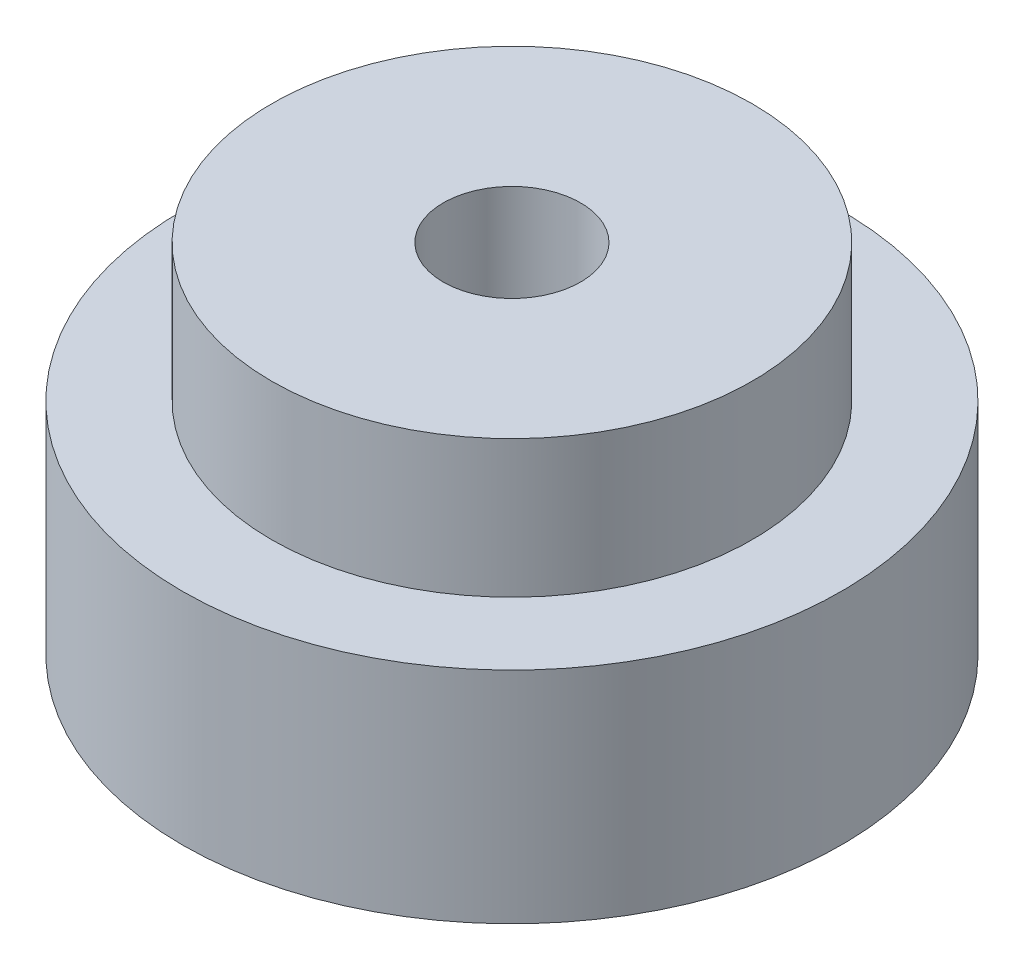
ISO-10303-21;
HEADER;
FILE_DESCRIPTION(('STEP AP214'),'2;1');
FILE_NAME('part.step','',(''),(''),'','','');
FILE_SCHEMA(('AUTOMOTIVE_DESIGN { 1 0 10303 214 1 1 1 1 }'));
ENDSEC;
DATA;
#1=APPLICATION_CONTEXT('core data for automotive mechanical design processes');
#2=APPLICATION_PROTOCOL_DEFINITION('international standard','automotive_design',2000,#1);
#3=PRODUCT_CONTEXT('',#1,'mechanical');
#4=PRODUCT('Part','Part','',(#3));
#5=PRODUCT_RELATED_PRODUCT_CATEGORY('part','',(#4));
#6=PRODUCT_DEFINITION_FORMATION('','',#4);
#7=PRODUCT_DEFINITION_CONTEXT('part definition',#1,'design');
#8=PRODUCT_DEFINITION('design','',#6,#7);
#9=PRODUCT_DEFINITION_SHAPE('','',#8);
#10=(LENGTH_UNIT() NAMED_UNIT(*) SI_UNIT(.MILLI.,.METRE.));
#11=(NAMED_UNIT(*) PLANE_ANGLE_UNIT() SI_UNIT($,.RADIAN.));
#12=(NAMED_UNIT(*) SI_UNIT($,.STERADIAN.) SOLID_ANGLE_UNIT());
#13=UNCERTAINTY_MEASURE_WITH_UNIT(LENGTH_MEASURE(1.E-05),#10,'distance_accuracy_value','');
#14=(GEOMETRIC_REPRESENTATION_CONTEXT(3) GLOBAL_UNCERTAINTY_ASSIGNED_CONTEXT((#13)) GLOBAL_UNIT_ASSIGNED_CONTEXT((#10,
#11,#12)) REPRESENTATION_CONTEXT('',''));
#15=CARTESIAN_POINT('',(0.,0.,0.));
#16=DIRECTION('',(0.,0.,1.));
#17=DIRECTION('',(1.,0.,0.));
#18=AXIS2_PLACEMENT_3D('',#15,#16,#17);
#19=CARTESIAN_POINT('',(0.,16.,0.));
#20=DIRECTION('',(0.,-1.,0.));
#21=DIRECTION('',(0.,0.,-1.));
#22=AXIS2_PLACEMENT_3D('',#19,#20,#21);
#23=CYLINDRICAL_SURFACE('',#22,24.);
#24=CARTESIAN_POINT('',(0.,16.,0.));
#25=DIRECTION('',(0.,1.,0.));
#26=DIRECTION('',(0.,0.,1.));
#27=AXIS2_PLACEMENT_3D('',#24,#25,#26);
#28=CIRCLE('',#27,24.);
#29=CARTESIAN_POINT('',(0.,16.,24.));
#30=VERTEX_POINT('',#29);
#31=EDGE_CURVE('E10',#30,#30,#28,.T.);
#32=ORIENTED_EDGE('',*,*,#31,.F.);
#33=EDGE_LOOP('',(#32));
#34=FACE_BOUND('',#33,.T.);
#35=CARTESIAN_POINT('',(0.,0.,0.));
#36=DIRECTION('',(0.,1.,0.));
#37=DIRECTION('',(0.,0.,1.));
#38=AXIS2_PLACEMENT_3D('',#35,#36,#37);
#39=CIRCLE('',#38,24.);
#40=CARTESIAN_POINT('',(0.,0.,24.));
#41=VERTEX_POINT('',#40);
#42=EDGE_CURVE('E34',#41,#41,#39,.T.);
#43=ORIENTED_EDGE('',*,*,#42,.T.);
#44=EDGE_LOOP('',(#43));
#45=FACE_BOUND('',#44,.T.);
#46=ADVANCED_FACE('F31',(#34,#45),#23,.T.);
#47=CARTESIAN_POINT('',(0.,16.,0.));
#48=DIRECTION('',(0.,1.,0.));
#49=DIRECTION('',(0.,0.,1.));
#50=AXIS2_PLACEMENT_3D('',#47,#48,#49);
#51=PLANE('',#50);
#52=CARTESIAN_POINT('',(0.,16.,0.));
#53=DIRECTION('',(0.,1.,0.));
#54=DIRECTION('',(0.,0.,1.));
#55=AXIS2_PLACEMENT_3D('',#52,#53,#54);
#56=CIRCLE('',#55,17.5);
#57=CARTESIAN_POINT('',(0.,16.,17.5));
#58=VERTEX_POINT('',#57);
#59=EDGE_CURVE('E43',#58,#58,#56,.T.);
#60=ORIENTED_EDGE('',*,*,#59,.F.);
#61=EDGE_LOOP('',(#60));
#62=FACE_BOUND('',#61,.T.);
#63=ORIENTED_EDGE('',*,*,#31,.T.);
#64=EDGE_LOOP('',(#63));
#65=FACE_BOUND('',#64,.T.);
#66=ADVANCED_FACE('F76',(#62,#65),#51,.T.);
#67=CARTESIAN_POINT('',(0.,0.,0.));
#68=DIRECTION('',(0.,1.,0.));
#69=DIRECTION('',(0.,0.,1.));
#70=AXIS2_PLACEMENT_3D('',#67,#68,#69);
#71=PLANE('',#70);
#72=CARTESIAN_POINT('',(0.,0.,0.));
#73=DIRECTION('',(0.,1.,0.));
#74=DIRECTION('',(0.,0.,1.));
#75=AXIS2_PLACEMENT_3D('',#72,#73,#74);
#76=CIRCLE('',#75,5.);
#77=CARTESIAN_POINT('',(0.,0.,5.));
#78=VERTEX_POINT('',#77);
#79=EDGE_CURVE('E46',#78,#78,#76,.T.);
#80=ORIENTED_EDGE('',*,*,#79,.T.);
#81=EDGE_LOOP('',(#80));
#82=FACE_BOUND('',#81,.T.);
#83=ORIENTED_EDGE('',*,*,#42,.F.);
#84=EDGE_LOOP('',(#83));
#85=FACE_BOUND('',#84,.T.);
#86=ADVANCED_FACE('F55',(#82,#85),#71,.F.);
#87=CARTESIAN_POINT('',(0.,26.,0.));
#88=DIRECTION('',(0.,-1.,0.));
#89=DIRECTION('',(0.,0.,-1.));
#90=AXIS2_PLACEMENT_3D('',#87,#88,#89);
#91=CYLINDRICAL_SURFACE('',#90,17.5);
#92=CARTESIAN_POINT('',(0.,26.,0.));
#93=DIRECTION('',(0.,1.,0.));
#94=DIRECTION('',(0.,0.,1.));
#95=AXIS2_PLACEMENT_3D('',#92,#93,#94);
#96=CIRCLE('',#95,17.5);
#97=CARTESIAN_POINT('',(0.,26.,17.5));
#98=VERTEX_POINT('',#97);
#99=EDGE_CURVE('E41',#98,#98,#96,.T.);
#100=ORIENTED_EDGE('',*,*,#99,.F.);
#101=EDGE_LOOP('',(#100));
#102=FACE_BOUND('',#101,.T.);
#103=ORIENTED_EDGE('',*,*,#59,.T.);
#104=EDGE_LOOP('',(#103));
#105=FACE_BOUND('',#104,.T.);
#106=ADVANCED_FACE('F67',(#102,#105),#91,.T.);
#107=CARTESIAN_POINT('',(0.,26.,0.));
#108=DIRECTION('',(0.,1.,0.));
#109=DIRECTION('',(0.,0.,1.));
#110=AXIS2_PLACEMENT_3D('',#107,#108,#109);
#111=PLANE('',#110);
#112=CARTESIAN_POINT('',(0.,26.,0.));
#113=DIRECTION('',(0.,1.,0.));
#114=DIRECTION('',(0.,0.,1.));
#115=AXIS2_PLACEMENT_3D('',#112,#113,#114);
#116=CIRCLE('',#115,5.);
#117=CARTESIAN_POINT('',(0.,26.,5.));
#118=VERTEX_POINT('',#117);
#119=EDGE_CURVE('E49',#118,#118,#116,.T.);
#120=ORIENTED_EDGE('',*,*,#119,.F.);
#121=EDGE_LOOP('',(#120));
#122=FACE_BOUND('',#121,.T.);
#123=ORIENTED_EDGE('',*,*,#99,.T.);
#124=EDGE_LOOP('',(#123));
#125=FACE_BOUND('',#124,.T.);
#126=ADVANCED_FACE('F61',(#122,#125),#111,.T.);
#127=CARTESIAN_POINT('',(0.,0.,0.));
#128=DIRECTION('',(0.,1.,0.));
#129=DIRECTION('',(0.,0.,1.));
#130=AXIS2_PLACEMENT_3D('',#127,#128,#129);
#131=CYLINDRICAL_SURFACE('',#130,5.);
#132=ORIENTED_EDGE('',*,*,#79,.F.);
#133=EDGE_LOOP('',(#132));
#134=FACE_BOUND('',#133,.T.);
#135=ORIENTED_EDGE('',*,*,#119,.T.);
#136=EDGE_LOOP('',(#135));
#137=FACE_BOUND('',#136,.T.);
#138=ADVANCED_FACE('F58',(#134,#137),#131,.F.);
#139=CLOSED_SHELL('',(#46,#66,#86,#106,#126,#138));
#140=MANIFOLD_SOLID_BREP('B2',#139);
#141=ADVANCED_BREP_SHAPE_REPRESENTATION('',(#18,#140),#14);
#142=SHAPE_DEFINITION_REPRESENTATION(#9,#141);
ENDSEC;
END-ISO-10303-21;
